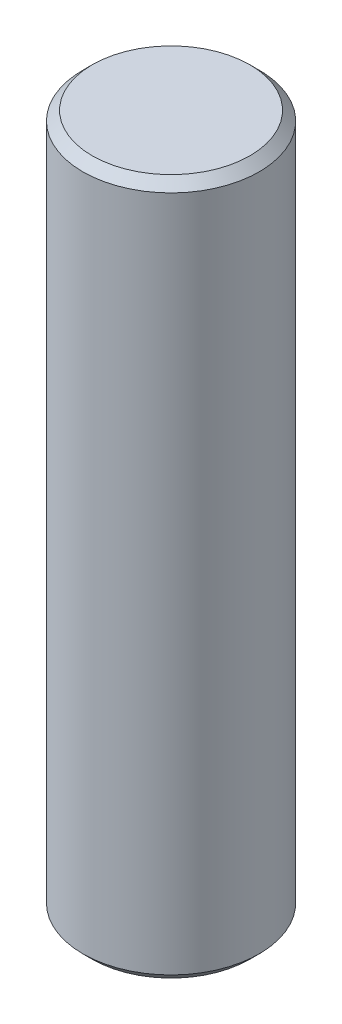
ISO-10303-21;
HEADER;
FILE_DESCRIPTION(('STEP AP214'),'2;1');
FILE_NAME('part.step','',(''),(''),'','','');
FILE_SCHEMA(('AUTOMOTIVE_DESIGN { 1 0 10303 214 1 1 1 1 }'));
ENDSEC;
DATA;
#1=APPLICATION_CONTEXT('core data for automotive mechanical design processes');
#2=APPLICATION_PROTOCOL_DEFINITION('international standard','automotive_design',2000,#1);
#3=PRODUCT_CONTEXT('',#1,'mechanical');
#4=PRODUCT('Part','Part','',(#3));
#5=PRODUCT_RELATED_PRODUCT_CATEGORY('part','',(#4));
#6=PRODUCT_DEFINITION_FORMATION('','',#4);
#7=PRODUCT_DEFINITION_CONTEXT('part definition',#1,'design');
#8=PRODUCT_DEFINITION('design','',#6,#7);
#9=PRODUCT_DEFINITION_SHAPE('','',#8);
#10=(LENGTH_UNIT() NAMED_UNIT(*) SI_UNIT(.MILLI.,.METRE.));
#11=(NAMED_UNIT(*) PLANE_ANGLE_UNIT() SI_UNIT($,.RADIAN.));
#12=(NAMED_UNIT(*) SI_UNIT($,.STERADIAN.) SOLID_ANGLE_UNIT());
#13=UNCERTAINTY_MEASURE_WITH_UNIT(LENGTH_MEASURE(1.E-05),#10,'distance_accuracy_value','');
#14=(GEOMETRIC_REPRESENTATION_CONTEXT(3) GLOBAL_UNCERTAINTY_ASSIGNED_CONTEXT((#13)) GLOBAL_UNIT_ASSIGNED_CONTEXT((#10,
#11,#12)) REPRESENTATION_CONTEXT('',''));
#15=CARTESIAN_POINT('',(0.,0.,0.));
#16=DIRECTION('',(0.,0.,1.));
#17=DIRECTION('',(1.,0.,0.));
#18=AXIS2_PLACEMENT_3D('',#15,#16,#17);
#19=CARTESIAN_POINT('',(0.,19.05,0.));
#20=DIRECTION('',(0.,-1.,0.));
#21=DIRECTION('',(0.,0.,-1.));
#22=AXIS2_PLACEMENT_3D('',#19,#20,#21);
#23=CYLINDRICAL_SURFACE('',#22,4.826);
#24=CARTESIAN_POINT('',(0.,-18.542,0.));
#25=DIRECTION('',(0.,1.,0.));
#26=DIRECTION('',(0.,0.,1.));
#27=AXIS2_PLACEMENT_3D('',#24,#25,#26);
#28=CIRCLE('',#27,4.826);
#29=CARTESIAN_POINT('',(0.,-18.542,4.826));
#30=VERTEX_POINT('',#29);
#31=EDGE_CURVE('E52',#30,#30,#28,.T.);
#32=ORIENTED_EDGE('',*,*,#31,.T.);
#33=EDGE_LOOP('',(#32));
#34=FACE_BOUND('',#33,.T.);
#35=CARTESIAN_POINT('',(0.,18.542,0.));
#36=DIRECTION('',(0.,1.,0.));
#37=DIRECTION('',(0.,0.,1.));
#38=AXIS2_PLACEMENT_3D('',#35,#36,#37);
#39=CIRCLE('',#38,4.826);
#40=CARTESIAN_POINT('',(0.,18.542,4.826));
#41=VERTEX_POINT('',#40);
#42=EDGE_CURVE('E57',#41,#41,#39,.F.);
#43=ORIENTED_EDGE('',*,*,#42,.T.);
#44=EDGE_LOOP('',(#43));
#45=FACE_BOUND('',#44,.T.);
#46=ADVANCED_FACE('F38',(#34,#45),#23,.T.);
#47=CARTESIAN_POINT('',(0.,19.05,0.));
#48=DIRECTION('',(0.,1.,0.));
#49=DIRECTION('',(0.,0.,1.));
#50=AXIS2_PLACEMENT_3D('',#47,#48,#49);
#51=PLANE('',#50);
#52=CARTESIAN_POINT('',(0.,19.05,0.));
#53=DIRECTION('',(0.,1.,0.));
#54=DIRECTION('',(0.,0.,1.));
#55=AXIS2_PLACEMENT_3D('',#52,#53,#54);
#56=CIRCLE('',#55,4.31800000000002);
#57=CARTESIAN_POINT('',(0.,19.05,4.31800000000002));
#58=VERTEX_POINT('',#57);
#59=EDGE_CURVE('E10',#58,#58,#56,.T.);
#60=ORIENTED_EDGE('',*,*,#59,.T.);
#61=EDGE_LOOP('',(#60));
#62=FACE_BOUND('',#61,.T.);
#63=ADVANCED_FACE('F74',(#62),#51,.T.);
#64=CARTESIAN_POINT('',(0.,-19.05,0.));
#65=DIRECTION('',(0.,1.,0.));
#66=DIRECTION('',(0.,0.,1.));
#67=AXIS2_PLACEMENT_3D('',#64,#65,#66);
#68=PLANE('',#67);
#69=CARTESIAN_POINT('',(0.,-19.05,0.));
#70=DIRECTION('',(0.,1.,0.));
#71=DIRECTION('',(0.,0.,1.));
#72=AXIS2_PLACEMENT_3D('',#69,#70,#71);
#73=CIRCLE('',#72,4.31799999999996);
#74=CARTESIAN_POINT('',(0.,-19.05,4.31799999999996));
#75=VERTEX_POINT('',#74);
#76=EDGE_CURVE('E47',#75,#75,#73,.F.);
#77=ORIENTED_EDGE('',*,*,#76,.T.);
#78=EDGE_LOOP('',(#77));
#79=FACE_BOUND('',#78,.T.);
#80=ADVANCED_FACE('F71',(#79),#68,.F.);
#81=CARTESIAN_POINT('',(0.,-18.542,0.));
#82=DIRECTION('',(0.,1.,0.));
#83=DIRECTION('',(0.,0.,1.));
#84=AXIS2_PLACEMENT_3D('',#81,#82,#83);
#85=CONICAL_SURFACE('',#84,4.826,0.785398163397452);
#86=ORIENTED_EDGE('',*,*,#76,.F.);
#87=EDGE_LOOP('',(#86));
#88=FACE_BOUND('',#87,.T.);
#89=ORIENTED_EDGE('',*,*,#31,.F.);
#90=EDGE_LOOP('',(#89));
#91=FACE_BOUND('',#90,.T.);
#92=ADVANCED_FACE('F67',(#88,#91),#85,.T.);
#93=CARTESIAN_POINT('',(0.,19.05,0.));
#94=DIRECTION('',(0.,-1.,0.));
#95=DIRECTION('',(0.,0.,-1.));
#96=AXIS2_PLACEMENT_3D('',#93,#94,#95);
#97=CONICAL_SURFACE('',#96,4.31800000000002,0.785398163397448);
#98=ORIENTED_EDGE('',*,*,#42,.F.);
#99=EDGE_LOOP('',(#98));
#100=FACE_BOUND('',#99,.T.);
#101=ORIENTED_EDGE('',*,*,#59,.F.);
#102=EDGE_LOOP('',(#101));
#103=FACE_BOUND('',#102,.T.);
#104=ADVANCED_FACE('F41',(#100,#103),#97,.T.);
#105=CLOSED_SHELL('',(#46,#63,#80,#92,#104));
#106=MANIFOLD_SOLID_BREP('B2',#105);
#107=ADVANCED_BREP_SHAPE_REPRESENTATION('',(#18,#106),#14);
#108=SHAPE_DEFINITION_REPRESENTATION(#9,#107);
ENDSEC;
END-ISO-10303-21;
